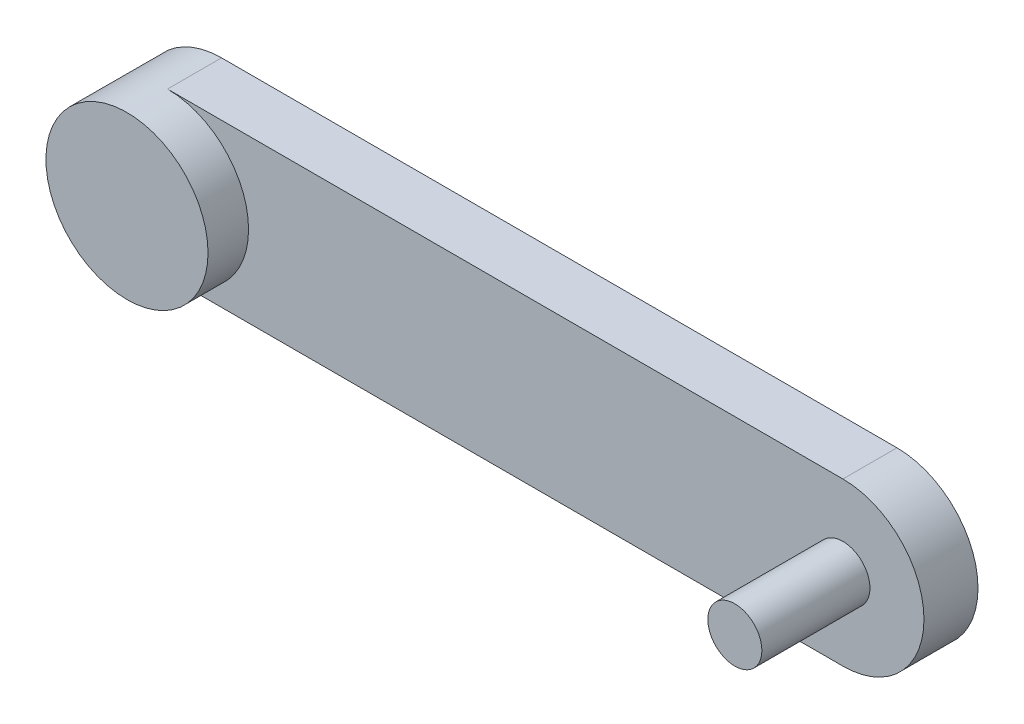
ISO-10303-21;
HEADER;
FILE_DESCRIPTION(('STEP AP214'),'2;1');
FILE_NAME('part.step','',(''),(''),'','','');
FILE_SCHEMA(('AUTOMOTIVE_DESIGN { 1 0 10303 214 1 1 1 1 }'));
ENDSEC;
DATA;
#1=APPLICATION_CONTEXT('core data for automotive mechanical design processes');
#2=APPLICATION_PROTOCOL_DEFINITION('international standard','automotive_design',2000,#1);
#3=PRODUCT_CONTEXT('',#1,'mechanical');
#4=PRODUCT('Part','Part','',(#3));
#5=PRODUCT_RELATED_PRODUCT_CATEGORY('part','',(#4));
#6=PRODUCT_DEFINITION_FORMATION('','',#4);
#7=PRODUCT_DEFINITION_CONTEXT('part definition',#1,'design');
#8=PRODUCT_DEFINITION('design','',#6,#7);
#9=PRODUCT_DEFINITION_SHAPE('','',#8);
#10=(LENGTH_UNIT() NAMED_UNIT(*) SI_UNIT(.MILLI.,.METRE.));
#11=(NAMED_UNIT(*) PLANE_ANGLE_UNIT() SI_UNIT($,.RADIAN.));
#12=(NAMED_UNIT(*) SI_UNIT($,.STERADIAN.) SOLID_ANGLE_UNIT());
#13=UNCERTAINTY_MEASURE_WITH_UNIT(LENGTH_MEASURE(1.E-05),#10,'distance_accuracy_value','');
#14=(GEOMETRIC_REPRESENTATION_CONTEXT(3) GLOBAL_UNCERTAINTY_ASSIGNED_CONTEXT((#13)) GLOBAL_UNIT_ASSIGNED_CONTEXT((#10,
#11,#12)) REPRESENTATION_CONTEXT('',''));
#15=CARTESIAN_POINT('',(0.,0.,0.));
#16=DIRECTION('',(0.,0.,1.));
#17=DIRECTION('',(1.,0.,0.));
#18=AXIS2_PLACEMENT_3D('',#15,#16,#17);
#19=CARTESIAN_POINT('',(-125.,0.,10.));
#20=DIRECTION('',(0.,0.,1.));
#21=DIRECTION('',(1.,0.,0.));
#22=AXIS2_PLACEMENT_3D('',#19,#20,#21);
#23=PLANE('',#22);
#24=CARTESIAN_POINT('',(125.,0.,10.));
#25=DIRECTION('',(0.,0.,1.));
#26=DIRECTION('',(1.,0.,0.));
#27=AXIS2_PLACEMENT_3D('',#24,#25,#26);
#28=CIRCLE('',#27,9.99999999999998);
#29=CARTESIAN_POINT('',(135.,0.,10.));
#30=VERTEX_POINT('',#29);
#31=EDGE_CURVE('E99',#30,#30,#28,.T.);
#32=ORIENTED_EDGE('',*,*,#31,.F.);
#33=EDGE_LOOP('',(#32));
#34=FACE_BOUND('',#33,.T.);
#35=CARTESIAN_POINT('',(-125.,0.,10.));
#36=DIRECTION('',(0.,0.,1.));
#37=DIRECTION('',(1.,0.,0.));
#38=AXIS2_PLACEMENT_3D('',#35,#36,#37);
#39=CIRCLE('',#38,30.);
#40=CARTESIAN_POINT('',(-125.,-30.,10.));
#41=VERTEX_POINT('',#40);
#42=CARTESIAN_POINT('',(-125.,30.,10.));
#43=VERTEX_POINT('',#42);
#44=EDGE_CURVE('E10',#41,#43,#39,.T.);
#45=ORIENTED_EDGE('',*,*,#44,.F.);
#46=DIRECTION('',(1.,0.,0.));
#47=VECTOR('',#46,1.);
#48=CARTESIAN_POINT('',(-125.,-30.,10.));
#49=LINE('',#48,#47);
#50=CARTESIAN_POINT('',(125.,-30.,10.));
#51=VERTEX_POINT('',#50);
#52=EDGE_CURVE('E82',#41,#51,#49,.T.);
#53=ORIENTED_EDGE('',*,*,#52,.T.);
#54=CARTESIAN_POINT('',(125.,0.,10.));
#55=DIRECTION('',(0.,0.,1.));
#56=DIRECTION('',(-1.,0.,0.));
#57=AXIS2_PLACEMENT_3D('',#54,#55,#56);
#58=CIRCLE('',#57,30.);
#59=CARTESIAN_POINT('',(125.,30.,10.));
#60=VERTEX_POINT('',#59);
#61=EDGE_CURVE('E34',#51,#60,#58,.T.);
#62=ORIENTED_EDGE('',*,*,#61,.T.);
#63=DIRECTION('',(-1.,0.,0.));
#64=VECTOR('',#63,1.);
#65=CARTESIAN_POINT('',(-125.,30.,10.));
#66=LINE('',#65,#64);
#67=EDGE_CURVE('E65',#60,#43,#66,.T.);
#68=ORIENTED_EDGE('',*,*,#67,.T.);
#69=EDGE_LOOP('',(#45,#53,#62,#68));
#70=FACE_BOUND('',#69,.T.);
#71=ADVANCED_FACE('F16',(#34,#70),#23,.T.);
#72=CARTESIAN_POINT('',(-125.,0.,-10.));
#73=DIRECTION('',(0.,0.,1.));
#74=DIRECTION('',(1.,0.,0.));
#75=AXIS2_PLACEMENT_3D('',#72,#73,#74);
#76=PLANE('',#75);
#77=CARTESIAN_POINT('',(-125.,0.,-10.));
#78=DIRECTION('',(0.,0.,1.));
#79=DIRECTION('',(1.,0.,0.));
#80=AXIS2_PLACEMENT_3D('',#77,#78,#79);
#81=CIRCLE('',#80,30.);
#82=CARTESIAN_POINT('',(-125.,30.,-10.));
#83=VERTEX_POINT('',#82);
#84=CARTESIAN_POINT('',(-125.,-30.,-10.));
#85=VERTEX_POINT('',#84);
#86=EDGE_CURVE('E75',#83,#85,#81,.T.);
#87=ORIENTED_EDGE('',*,*,#86,.F.);
#88=DIRECTION('',(-1.,0.,0.));
#89=VECTOR('',#88,1.);
#90=CARTESIAN_POINT('',(-125.,30.,-10.));
#91=LINE('',#90,#89);
#92=CARTESIAN_POINT('',(125.,30.,-10.));
#93=VERTEX_POINT('',#92);
#94=EDGE_CURVE('E57',#93,#83,#91,.T.);
#95=ORIENTED_EDGE('',*,*,#94,.F.);
#96=CARTESIAN_POINT('',(125.,0.,-10.));
#97=DIRECTION('',(0.,0.,1.));
#98=DIRECTION('',(-1.,0.,0.));
#99=AXIS2_PLACEMENT_3D('',#96,#97,#98);
#100=CIRCLE('',#99,30.);
#101=CARTESIAN_POINT('',(125.,-30.,-10.));
#102=VERTEX_POINT('',#101);
#103=EDGE_CURVE('E51',#102,#93,#100,.T.);
#104=ORIENTED_EDGE('',*,*,#103,.F.);
#105=DIRECTION('',(1.,0.,0.));
#106=VECTOR('',#105,1.);
#107=CARTESIAN_POINT('',(-125.,-30.,-10.));
#108=LINE('',#107,#106);
#109=EDGE_CURVE('E84',#85,#102,#108,.T.);
#110=ORIENTED_EDGE('',*,*,#109,.F.);
#111=EDGE_LOOP('',(#87,#95,#104,#110));
#112=FACE_BOUND('',#111,.T.);
#113=CARTESIAN_POINT('',(-125.,0.,-10.));
#114=DIRECTION('',(0.,0.,1.));
#115=DIRECTION('',(1.,0.,0.));
#116=AXIS2_PLACEMENT_3D('',#113,#114,#115);
#117=CIRCLE('',#116,9.84258704865271);
#118=CARTESIAN_POINT('',(-115.157412951347,0.,-10.));
#119=VERTEX_POINT('',#118);
#120=EDGE_CURVE('E86',#119,#119,#117,.T.);
#121=ORIENTED_EDGE('',*,*,#120,.T.);
#122=EDGE_LOOP('',(#121));
#123=FACE_BOUND('',#122,.T.);
#124=ADVANCED_FACE('F115',(#112,#123),#76,.F.);
#125=CARTESIAN_POINT('',(-125.,0.,10.));
#126=DIRECTION('',(0.,0.,-1.));
#127=DIRECTION('',(-1.,0.,0.));
#128=AXIS2_PLACEMENT_3D('',#125,#126,#127);
#129=CYLINDRICAL_SURFACE('',#128,30.);
#130=ORIENTED_EDGE('',*,*,#86,.T.);
#131=DIRECTION('',(0.,0.,-1.));
#132=VECTOR('',#131,1.);
#133=CARTESIAN_POINT('',(-125.,-30.,10.));
#134=LINE('',#133,#132);
#135=EDGE_CURVE('E20',#41,#85,#134,.T.);
#136=ORIENTED_EDGE('',*,*,#135,.F.);
#137=ORIENTED_EDGE('',*,*,#44,.T.);
#138=DIRECTION('',(0.,0.,-1.));
#139=VECTOR('',#138,1.);
#140=CARTESIAN_POINT('',(-125.,30.,10.));
#141=LINE('',#140,#139);
#142=EDGE_CURVE('E63',#43,#83,#141,.T.);
#143=ORIENTED_EDGE('',*,*,#142,.T.);
#144=EDGE_LOOP('',(#130,#136,#137,#143));
#145=FACE_BOUND('',#144,.T.);
#146=CARTESIAN_POINT('',(-125.,0.,25.));
#147=DIRECTION('',(0.,0.,1.));
#148=DIRECTION('',(1.,0.,0.));
#149=AXIS2_PLACEMENT_3D('',#146,#147,#148);
#150=CIRCLE('',#149,30.);
#151=CARTESIAN_POINT('',(-95.,0.,25.));
#152=VERTEX_POINT('',#151);
#153=EDGE_CURVE('E94',#152,#152,#150,.T.);
#154=ORIENTED_EDGE('',*,*,#153,.F.);
#155=EDGE_LOOP('',(#154));
#156=FACE_BOUND('',#155,.T.);
#157=ADVANCED_FACE('F18',(#145,#156),#129,.T.);
#158=CARTESIAN_POINT('',(-125.,-30.,10.));
#159=DIRECTION('',(0.,1.,0.));
#160=DIRECTION('',(-1.,0.,0.));
#161=AXIS2_PLACEMENT_3D('',#158,#159,#160);
#162=PLANE('',#161);
#163=ORIENTED_EDGE('',*,*,#109,.T.);
#164=DIRECTION('',(0.,0.,-1.));
#165=VECTOR('',#164,1.);
#166=CARTESIAN_POINT('',(125.,-30.,10.));
#167=LINE('',#166,#165);
#168=EDGE_CURVE('E77',#51,#102,#167,.T.);
#169=ORIENTED_EDGE('',*,*,#168,.F.);
#170=ORIENTED_EDGE('',*,*,#52,.F.);
#171=ORIENTED_EDGE('',*,*,#135,.T.);
#172=EDGE_LOOP('',(#163,#169,#170,#171));
#173=FACE_BOUND('',#172,.T.);
#174=ADVANCED_FACE('F131',(#173),#162,.F.);
#175=CARTESIAN_POINT('',(125.,0.,10.));
#176=DIRECTION('',(0.,0.,-1.));
#177=DIRECTION('',(-1.,0.,0.));
#178=AXIS2_PLACEMENT_3D('',#175,#176,#177);
#179=CYLINDRICAL_SURFACE('',#178,30.);
#180=ORIENTED_EDGE('',*,*,#103,.T.);
#181=DIRECTION('',(0.,0.,-1.));
#182=VECTOR('',#181,1.);
#183=CARTESIAN_POINT('',(125.,30.,10.));
#184=LINE('',#183,#182);
#185=EDGE_CURVE('E69',#60,#93,#184,.T.);
#186=ORIENTED_EDGE('',*,*,#185,.F.);
#187=ORIENTED_EDGE('',*,*,#61,.F.);
#188=ORIENTED_EDGE('',*,*,#168,.T.);
#189=EDGE_LOOP('',(#180,#186,#187,#188));
#190=FACE_BOUND('',#189,.T.);
#191=ADVANCED_FACE('F129',(#190),#179,.T.);
#192=CARTESIAN_POINT('',(-125.,30.,10.));
#193=DIRECTION('',(0.,-1.,0.));
#194=DIRECTION('',(1.,0.,0.));
#195=AXIS2_PLACEMENT_3D('',#192,#193,#194);
#196=PLANE('',#195);
#197=ORIENTED_EDGE('',*,*,#94,.T.);
#198=ORIENTED_EDGE('',*,*,#142,.F.);
#199=ORIENTED_EDGE('',*,*,#67,.F.);
#200=ORIENTED_EDGE('',*,*,#185,.T.);
#201=EDGE_LOOP('',(#197,#198,#199,#200));
#202=FACE_BOUND('',#201,.T.);
#203=ADVANCED_FACE('F64',(#202),#196,.F.);
#204=CARTESIAN_POINT('',(-125.,0.,10.));
#205=DIRECTION('',(0.,0.,-1.));
#206=DIRECTION('',(-1.,0.,0.));
#207=AXIS2_PLACEMENT_3D('',#204,#205,#206);
#208=CYLINDRICAL_SURFACE('',#207,9.84258704865271);
#209=CARTESIAN_POINT('',(-125.,0.,10.));
#210=DIRECTION('',(0.,0.,1.));
#211=DIRECTION('',(1.,0.,0.));
#212=AXIS2_PLACEMENT_3D('',#209,#210,#211);
#213=CIRCLE('',#212,9.84258704865271);
#214=CARTESIAN_POINT('',(-115.157412951347,0.,10.));
#215=VERTEX_POINT('',#214);
#216=EDGE_CURVE('E92',#215,#215,#213,.T.);
#217=ORIENTED_EDGE('',*,*,#216,.T.);
#218=EDGE_LOOP('',(#217));
#219=FACE_BOUND('',#218,.T.);
#220=ORIENTED_EDGE('',*,*,#120,.F.);
#221=EDGE_LOOP('',(#220));
#222=FACE_BOUND('',#221,.T.);
#223=ADVANCED_FACE('F124',(#219,#222),#208,.F.);
#224=CARTESIAN_POINT('',(-125.,0.,25.));
#225=DIRECTION('',(0.,0.,1.));
#226=DIRECTION('',(1.,0.,0.));
#227=AXIS2_PLACEMENT_3D('',#224,#225,#226);
#228=PLANE('',#227);
#229=ORIENTED_EDGE('',*,*,#153,.T.);
#230=EDGE_LOOP('',(#229));
#231=FACE_BOUND('',#230,.T.);
#232=ADVANCED_FACE('F140',(#231),#228,.T.);
#233=CARTESIAN_POINT('',(-125.,0.,10.));
#234=DIRECTION('',(0.,0.,1.));
#235=DIRECTION('',(1.,0.,0.));
#236=AXIS2_PLACEMENT_3D('',#233,#234,#235);
#237=PLANE('',#236);
#238=ORIENTED_EDGE('',*,*,#216,.F.);
#239=EDGE_LOOP('',(#238));
#240=FACE_BOUND('',#239,.T.);
#241=ADVANCED_FACE('F110',(#240),#237,.F.);
#242=CARTESIAN_POINT('',(125.,0.,50.));
#243=DIRECTION('',(0.,0.,-1.));
#244=DIRECTION('',(-1.,0.,0.));
#245=AXIS2_PLACEMENT_3D('',#242,#243,#244);
#246=CYLINDRICAL_SURFACE('',#245,9.99999999999998);
#247=CARTESIAN_POINT('',(125.,0.,50.));
#248=DIRECTION('',(0.,0.,1.));
#249=DIRECTION('',(1.,0.,0.));
#250=AXIS2_PLACEMENT_3D('',#247,#248,#249);
#251=CIRCLE('',#250,9.99999999999998);
#252=CARTESIAN_POINT('',(135.,0.,50.));
#253=VERTEX_POINT('',#252);
#254=EDGE_CURVE('E98',#253,#253,#251,.T.);
#255=ORIENTED_EDGE('',*,*,#254,.F.);
#256=EDGE_LOOP('',(#255));
#257=FACE_BOUND('',#256,.T.);
#258=ORIENTED_EDGE('',*,*,#31,.T.);
#259=EDGE_LOOP('',(#258));
#260=FACE_BOUND('',#259,.T.);
#261=ADVANCED_FACE('F107',(#257,#260),#246,.T.);
#262=CARTESIAN_POINT('',(125.,0.,50.));
#263=DIRECTION('',(0.,0.,1.));
#264=DIRECTION('',(1.,0.,0.));
#265=AXIS2_PLACEMENT_3D('',#262,#263,#264);
#266=PLANE('',#265);
#267=ORIENTED_EDGE('',*,*,#254,.T.);
#268=EDGE_LOOP('',(#267));
#269=FACE_BOUND('',#268,.T.);
#270=ADVANCED_FACE('F105',(#269),#266,.T.);
#271=CLOSED_SHELL('',(#71,#124,#157,#174,#191,#203,#223,#232,#241,#261,#270));
#272=MANIFOLD_SOLID_BREP('B1',#271);
#273=ADVANCED_BREP_SHAPE_REPRESENTATION('',(#18,#272),#14);
#274=SHAPE_DEFINITION_REPRESENTATION(#9,#273);
ENDSEC;
END-ISO-10303-21;
